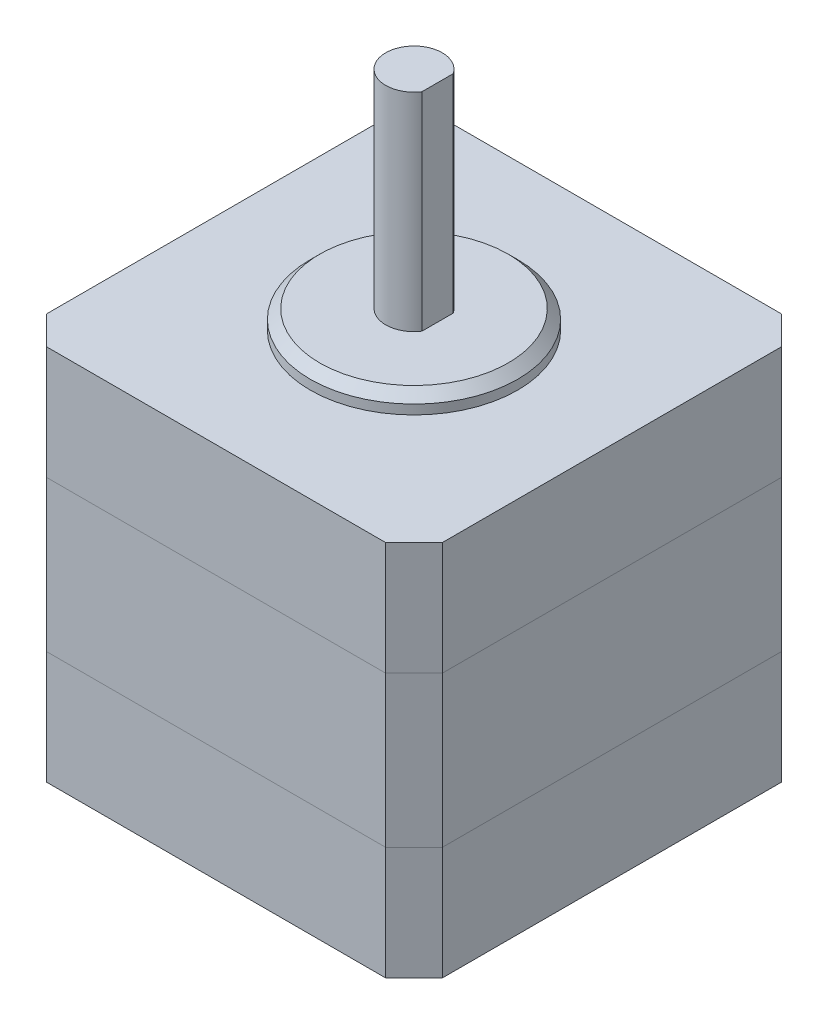
ISO-10303-21;
HEADER;
FILE_DESCRIPTION(('STEP AP214'),'2;1');
FILE_NAME('part.step','',(''),(''),'','','');
FILE_SCHEMA(('AUTOMOTIVE_DESIGN { 1 0 10303 214 1 1 1 1 }'));
ENDSEC;
DATA;
#1=APPLICATION_CONTEXT('core data for automotive mechanical design processes');
#2=APPLICATION_PROTOCOL_DEFINITION('international standard','automotive_design',2000,#1);
#3=PRODUCT_CONTEXT('',#1,'mechanical');
#4=PRODUCT('Part','Part','',(#3));
#5=PRODUCT_RELATED_PRODUCT_CATEGORY('part','',(#4));
#6=PRODUCT_DEFINITION_FORMATION('','',#4);
#7=PRODUCT_DEFINITION_CONTEXT('part definition',#1,'design');
#8=PRODUCT_DEFINITION('design','',#6,#7);
#9=PRODUCT_DEFINITION_SHAPE('','',#8);
#10=(LENGTH_UNIT() NAMED_UNIT(*) SI_UNIT(.MILLI.,.METRE.));
#11=(NAMED_UNIT(*) PLANE_ANGLE_UNIT() SI_UNIT($,.RADIAN.));
#12=(NAMED_UNIT(*) SI_UNIT($,.STERADIAN.) SOLID_ANGLE_UNIT());
#13=UNCERTAINTY_MEASURE_WITH_UNIT(LENGTH_MEASURE(1.E-05),#10,'distance_accuracy_value','');
#14=(GEOMETRIC_REPRESENTATION_CONTEXT(3) GLOBAL_UNCERTAINTY_ASSIGNED_CONTEXT((#13)) GLOBAL_UNIT_ASSIGNED_CONTEXT((#10,
#11,#12)) REPRESENTATION_CONTEXT('',''));
#15=CARTESIAN_POINT('',(0.,0.,0.));
#16=DIRECTION('',(0.,0.,1.));
#17=DIRECTION('',(1.,0.,0.));
#18=AXIS2_PLACEMENT_3D('',#15,#16,#17);
#19=CARTESIAN_POINT('',(-21.,40.,21.));
#20=DIRECTION('',(1.,0.,0.));
#21=DIRECTION('',(0.,0.,-1.));
#22=AXIS2_PLACEMENT_3D('',#19,#20,#21);
#23=PLANE('',#22);
#24=DIRECTION('',(0.,1.,0.));
#25=VECTOR('',#24,1.);
#26=CARTESIAN_POINT('',(-21.,40.,18.));
#27=LINE('',#26,#25);
#28=CARTESIAN_POINT('',(-21.,0.,18.));
#29=VERTEX_POINT('',#28);
#30=CARTESIAN_POINT('',(-21.,12.,18.));
#31=VERTEX_POINT('',#30);
#32=EDGE_CURVE('E299',#29,#31,#27,.T.);
#33=ORIENTED_EDGE('',*,*,#32,.T.);
#34=DIRECTION('',(0.,0.,-1.));
#35=VECTOR('',#34,1.);
#36=CARTESIAN_POINT('',(-21.,12.,21.));
#37=LINE('',#36,#35);
#38=CARTESIAN_POINT('',(-21.,12.,-18.));
#39=VERTEX_POINT('',#38);
#40=EDGE_CURVE('E204',#31,#39,#37,.T.);
#41=ORIENTED_EDGE('',*,*,#40,.T.);
#42=DIRECTION('',(0.,-1.,0.));
#43=VECTOR('',#42,1.);
#44=CARTESIAN_POINT('',(-21.,40.,-18.));
#45=LINE('',#44,#43);
#46=CARTESIAN_POINT('',(-21.,0.,-18.));
#47=VERTEX_POINT('',#46);
#48=EDGE_CURVE('E291',#39,#47,#45,.T.);
#49=ORIENTED_EDGE('',*,*,#48,.T.);
#50=DIRECTION('',(0.,0.,1.));
#51=VECTOR('',#50,1.);
#52=CARTESIAN_POINT('',(-21.,0.,21.));
#53=LINE('',#52,#51);
#54=EDGE_CURVE('E226',#47,#29,#53,.T.);
#55=ORIENTED_EDGE('',*,*,#54,.T.);
#56=EDGE_LOOP('',(#33,#41,#49,#55));
#57=FACE_BOUND('',#56,.T.);
#58=ADVANCED_FACE('F44',(#57),#23,.F.);
#59=CARTESIAN_POINT('',(-21.,40.,21.));
#60=DIRECTION('',(0.,0.,-1.));
#61=DIRECTION('',(-1.,0.,0.));
#62=AXIS2_PLACEMENT_3D('',#59,#60,#61);
#63=PLANE('',#62);
#64=DIRECTION('',(0.,1.,0.));
#65=VECTOR('',#64,1.);
#66=CARTESIAN_POINT('',(18.,40.,21.));
#67=LINE('',#66,#65);
#68=CARTESIAN_POINT('',(18.,0.,21.));
#69=VERTEX_POINT('',#68);
#70=CARTESIAN_POINT('',(18.,12.,21.));
#71=VERTEX_POINT('',#70);
#72=EDGE_CURVE('E287',#69,#71,#67,.T.);
#73=ORIENTED_EDGE('',*,*,#72,.T.);
#74=DIRECTION('',(-1.,0.,0.));
#75=VECTOR('',#74,1.);
#76=CARTESIAN_POINT('',(-21.,12.,21.));
#77=LINE('',#76,#75);
#78=CARTESIAN_POINT('',(-18.,12.,21.));
#79=VERTEX_POINT('',#78);
#80=EDGE_CURVE('E357',#71,#79,#77,.T.);
#81=ORIENTED_EDGE('',*,*,#80,.T.);
#82=DIRECTION('',(0.,-1.,0.));
#83=VECTOR('',#82,1.);
#84=CARTESIAN_POINT('',(-18.,40.,21.));
#85=LINE('',#84,#83);
#86=CARTESIAN_POINT('',(-18.,0.,21.));
#87=VERTEX_POINT('',#86);
#88=EDGE_CURVE('E280',#79,#87,#85,.T.);
#89=ORIENTED_EDGE('',*,*,#88,.T.);
#90=DIRECTION('',(1.,0.,0.));
#91=VECTOR('',#90,1.);
#92=CARTESIAN_POINT('',(-21.,0.,21.));
#93=LINE('',#92,#91);
#94=EDGE_CURVE('E210',#87,#69,#93,.T.);
#95=ORIENTED_EDGE('',*,*,#94,.T.);
#96=EDGE_LOOP('',(#73,#81,#89,#95));
#97=FACE_BOUND('',#96,.T.);
#98=ADVANCED_FACE('F375',(#97),#63,.F.);
#99=CARTESIAN_POINT('',(21.,40.,21.));
#100=DIRECTION('',(-1.,0.,0.));
#101=DIRECTION('',(0.,0.,1.));
#102=AXIS2_PLACEMENT_3D('',#99,#100,#101);
#103=PLANE('',#102);
#104=DIRECTION('',(0.,1.,0.));
#105=VECTOR('',#104,1.);
#106=CARTESIAN_POINT('',(21.,40.,-18.));
#107=LINE('',#106,#105);
#108=CARTESIAN_POINT('',(21.,0.,-18.));
#109=VERTEX_POINT('',#108);
#110=CARTESIAN_POINT('',(21.,12.,-18.));
#111=VERTEX_POINT('',#110);
#112=EDGE_CURVE('E263',#109,#111,#107,.T.);
#113=ORIENTED_EDGE('',*,*,#112,.T.);
#114=DIRECTION('',(0.,0.,1.));
#115=VECTOR('',#114,1.);
#116=CARTESIAN_POINT('',(21.,12.,21.));
#117=LINE('',#116,#115);
#118=CARTESIAN_POINT('',(21.,12.,18.));
#119=VERTEX_POINT('',#118);
#120=EDGE_CURVE('E354',#111,#119,#117,.T.);
#121=ORIENTED_EDGE('',*,*,#120,.T.);
#122=DIRECTION('',(0.,-1.,0.));
#123=VECTOR('',#122,1.);
#124=CARTESIAN_POINT('',(21.,40.,18.));
#125=LINE('',#124,#123);
#126=CARTESIAN_POINT('',(21.,0.,18.));
#127=VERTEX_POINT('',#126);
#128=EDGE_CURVE('E256',#119,#127,#125,.T.);
#129=ORIENTED_EDGE('',*,*,#128,.T.);
#130=DIRECTION('',(0.,0.,-1.));
#131=VECTOR('',#130,1.);
#132=CARTESIAN_POINT('',(21.,0.,21.));
#133=LINE('',#132,#131);
#134=EDGE_CURVE('E190',#127,#109,#133,.T.);
#135=ORIENTED_EDGE('',*,*,#134,.T.);
#136=EDGE_LOOP('',(#113,#121,#129,#135));
#137=FACE_BOUND('',#136,.T.);
#138=ADVANCED_FACE('F383',(#137),#103,.F.);
#139=CARTESIAN_POINT('',(-21.,40.,-21.));
#140=DIRECTION('',(0.,0.,1.));
#141=DIRECTION('',(1.,0.,0.));
#142=AXIS2_PLACEMENT_3D('',#139,#140,#141);
#143=PLANE('',#142);
#144=DIRECTION('',(0.,1.,0.));
#145=VECTOR('',#144,1.);
#146=CARTESIAN_POINT('',(-18.,40.,-21.));
#147=LINE('',#146,#145);
#148=CARTESIAN_POINT('',(-18.,0.,-21.));
#149=VERTEX_POINT('',#148);
#150=CARTESIAN_POINT('',(-18.,12.,-21.));
#151=VERTEX_POINT('',#150);
#152=EDGE_CURVE('E233',#149,#151,#147,.T.);
#153=ORIENTED_EDGE('',*,*,#152,.T.);
#154=DIRECTION('',(1.,0.,0.));
#155=VECTOR('',#154,1.);
#156=CARTESIAN_POINT('',(-21.,12.,-21.));
#157=LINE('',#156,#155);
#158=CARTESIAN_POINT('',(18.,12.,-21.));
#159=VERTEX_POINT('',#158);
#160=EDGE_CURVE('E68',#151,#159,#157,.T.);
#161=ORIENTED_EDGE('',*,*,#160,.T.);
#162=DIRECTION('',(0.,-1.,0.));
#163=VECTOR('',#162,1.);
#164=CARTESIAN_POINT('',(18.,40.,-21.));
#165=LINE('',#164,#163);
#166=CARTESIAN_POINT('',(18.,0.,-21.));
#167=VERTEX_POINT('',#166);
#168=EDGE_CURVE('E237',#159,#167,#165,.T.);
#169=ORIENTED_EDGE('',*,*,#168,.T.);
#170=DIRECTION('',(-1.,0.,0.));
#171=VECTOR('',#170,1.);
#172=CARTESIAN_POINT('',(-21.,0.,-21.));
#173=LINE('',#172,#171);
#174=EDGE_CURVE('E195',#167,#149,#173,.T.);
#175=ORIENTED_EDGE('',*,*,#174,.T.);
#176=EDGE_LOOP('',(#153,#161,#169,#175));
#177=FACE_BOUND('',#176,.T.);
#178=ADVANCED_FACE('F403',(#177),#143,.F.);
#179=CARTESIAN_POINT('',(-21.,40.,-18.));
#180=DIRECTION('',(0.707106781186546,0.,0.707106781186549));
#181=DIRECTION('',(0.,-1.,0.));
#182=AXIS2_PLACEMENT_3D('',#179,#180,#181);
#183=PLANE('',#182);
#184=CARTESIAN_POINT('',(-18.,28.,-21.));
#185=VERTEX_POINT('',#184);
#186=EDGE_CURVE('E238',#151,#185,#147,.T.);
#187=ORIENTED_EDGE('',*,*,#186,.F.);
#188=DIRECTION('',(-0.707106781186549,0.,0.707106781186546));
#189=VECTOR('',#188,1.);
#190=CARTESIAN_POINT('',(-21.,12.,-18.));
#191=LINE('',#190,#189);
#192=EDGE_CURVE('E348',#151,#39,#191,.T.);
#193=ORIENTED_EDGE('',*,*,#192,.T.);
#194=CARTESIAN_POINT('',(-21.,28.,-18.));
#195=VERTEX_POINT('',#194);
#196=EDGE_CURVE('E298',#195,#39,#45,.T.);
#197=ORIENTED_EDGE('',*,*,#196,.F.);
#198=DIRECTION('',(0.707106781186549,0.,-0.707106781186546));
#199=VECTOR('',#198,1.);
#200=CARTESIAN_POINT('',(-21.,28.,-18.));
#201=LINE('',#200,#199);
#202=EDGE_CURVE('E312',#195,#185,#201,.T.);
#203=ORIENTED_EDGE('',*,*,#202,.T.);
#204=EDGE_LOOP('',(#187,#193,#197,#203));
#205=FACE_BOUND('',#204,.T.);
#206=ADVANCED_FACE('F485',(#205),#183,.F.);
#207=CARTESIAN_POINT('',(-18.,40.,21.));
#208=DIRECTION('',(0.707106781186549,0.,-0.707106781186546));
#209=DIRECTION('',(0.,-1.,0.));
#210=AXIS2_PLACEMENT_3D('',#207,#208,#209);
#211=PLANE('',#210);
#212=CARTESIAN_POINT('',(-21.,28.,18.));
#213=VERTEX_POINT('',#212);
#214=EDGE_CURVE('E304',#31,#213,#27,.T.);
#215=ORIENTED_EDGE('',*,*,#214,.F.);
#216=DIRECTION('',(0.707106781186546,0.,0.707106781186549));
#217=VECTOR('',#216,1.);
#218=CARTESIAN_POINT('',(-18.,12.,21.));
#219=LINE('',#218,#217);
#220=EDGE_CURVE('E344',#31,#79,#219,.T.);
#221=ORIENTED_EDGE('',*,*,#220,.T.);
#222=CARTESIAN_POINT('',(-18.,28.,21.));
#223=VERTEX_POINT('',#222);
#224=EDGE_CURVE('E286',#223,#79,#85,.T.);
#225=ORIENTED_EDGE('',*,*,#224,.F.);
#226=DIRECTION('',(-0.707106781186546,0.,-0.707106781186549));
#227=VECTOR('',#226,1.);
#228=CARTESIAN_POINT('',(-18.,28.,21.));
#229=LINE('',#228,#227);
#230=EDGE_CURVE('E308',#223,#213,#229,.T.);
#231=ORIENTED_EDGE('',*,*,#230,.T.);
#232=EDGE_LOOP('',(#215,#221,#225,#231));
#233=FACE_BOUND('',#232,.T.);
#234=ADVANCED_FACE('F416',(#233),#211,.F.);
#235=CARTESIAN_POINT('',(21.,40.,18.));
#236=DIRECTION('',(-0.707106781186546,0.,-0.707106781186549));
#237=DIRECTION('',(0.,-1.,0.));
#238=AXIS2_PLACEMENT_3D('',#235,#236,#237);
#239=PLANE('',#238);
#240=CARTESIAN_POINT('',(18.,28.,21.));
#241=VERTEX_POINT('',#240);
#242=EDGE_CURVE('E292',#71,#241,#67,.T.);
#243=ORIENTED_EDGE('',*,*,#242,.F.);
#244=DIRECTION('',(0.707106781186549,0.,-0.707106781186546));
#245=VECTOR('',#244,1.);
#246=CARTESIAN_POINT('',(21.,12.,18.));
#247=LINE('',#246,#245);
#248=EDGE_CURVE('E340',#71,#119,#247,.T.);
#249=ORIENTED_EDGE('',*,*,#248,.T.);
#250=CARTESIAN_POINT('',(21.,28.,18.));
#251=VERTEX_POINT('',#250);
#252=EDGE_CURVE('E262',#251,#119,#125,.T.);
#253=ORIENTED_EDGE('',*,*,#252,.F.);
#254=DIRECTION('',(-0.707106781186549,0.,0.707106781186546));
#255=VECTOR('',#254,1.);
#256=CARTESIAN_POINT('',(21.,28.,18.));
#257=LINE('',#256,#255);
#258=EDGE_CURVE('E303',#251,#241,#257,.T.);
#259=ORIENTED_EDGE('',*,*,#258,.T.);
#260=EDGE_LOOP('',(#243,#249,#253,#259));
#261=FACE_BOUND('',#260,.T.);
#262=ADVANCED_FACE('F438',(#261),#239,.F.);
#263=CARTESIAN_POINT('',(18.,40.,-21.));
#264=DIRECTION('',(-0.707106781186549,0.,0.707106781186546));
#265=DIRECTION('',(0.,-1.,0.));
#266=AXIS2_PLACEMENT_3D('',#263,#264,#265);
#267=PLANE('',#266);
#268=CARTESIAN_POINT('',(21.,28.,-18.));
#269=VERTEX_POINT('',#268);
#270=EDGE_CURVE('E268',#111,#269,#107,.T.);
#271=ORIENTED_EDGE('',*,*,#270,.F.);
#272=DIRECTION('',(-0.707106781186546,0.,-0.707106781186549));
#273=VECTOR('',#272,1.);
#274=CARTESIAN_POINT('',(18.,12.,-21.));
#275=LINE('',#274,#273);
#276=EDGE_CURVE('E336',#111,#159,#275,.T.);
#277=ORIENTED_EDGE('',*,*,#276,.T.);
#278=CARTESIAN_POINT('',(18.,28.,-21.));
#279=VERTEX_POINT('',#278);
#280=EDGE_CURVE('E244',#279,#159,#165,.T.);
#281=ORIENTED_EDGE('',*,*,#280,.F.);
#282=DIRECTION('',(0.707106781186546,0.,0.707106781186549));
#283=VECTOR('',#282,1.);
#284=CARTESIAN_POINT('',(18.,28.,-21.));
#285=LINE('',#284,#283);
#286=EDGE_CURVE('E316',#279,#269,#285,.T.);
#287=ORIENTED_EDGE('',*,*,#286,.T.);
#288=EDGE_LOOP('',(#271,#277,#281,#287));
#289=FACE_BOUND('',#288,.T.);
#290=ADVANCED_FACE('F391',(#289),#267,.F.);
#291=CARTESIAN_POINT('',(-21.,40.,-18.));
#292=VERTEX_POINT('',#291);
#293=EDGE_CURVE('E293',#292,#195,#45,.T.);
#294=ORIENTED_EDGE('',*,*,#293,.T.);
#295=DIRECTION('',(0.,0.,1.));
#296=VECTOR('',#295,1.);
#297=CARTESIAN_POINT('',(-21.,28.,21.));
#298=LINE('',#297,#296);
#299=EDGE_CURVE('E332',#195,#213,#298,.T.);
#300=ORIENTED_EDGE('',*,*,#299,.T.);
#301=CARTESIAN_POINT('',(-21.,40.,18.));
#302=VERTEX_POINT('',#301);
#303=EDGE_CURVE('E297',#213,#302,#27,.T.);
#304=ORIENTED_EDGE('',*,*,#303,.T.);
#305=DIRECTION('',(0.,0.,1.));
#306=VECTOR('',#305,1.);
#307=CARTESIAN_POINT('',(-21.,40.,21.));
#308=LINE('',#307,#306);
#309=EDGE_CURVE('E214',#292,#302,#308,.T.);
#310=ORIENTED_EDGE('',*,*,#309,.F.);
#311=EDGE_LOOP('',(#294,#300,#304,#310));
#312=FACE_BOUND('',#311,.T.);
#313=ADVANCED_FACE('F378',(#312),#23,.F.);
#314=CARTESIAN_POINT('',(18.,40.,-21.));
#315=VERTEX_POINT('',#314);
#316=EDGE_CURVE('E239',#315,#279,#165,.T.);
#317=ORIENTED_EDGE('',*,*,#316,.T.);
#318=DIRECTION('',(-1.,0.,0.));
#319=VECTOR('',#318,1.);
#320=CARTESIAN_POINT('',(-21.,28.,-21.));
#321=LINE('',#320,#319);
#322=EDGE_CURVE('E328',#279,#185,#321,.T.);
#323=ORIENTED_EDGE('',*,*,#322,.T.);
#324=CARTESIAN_POINT('',(-18.,40.,-21.));
#325=VERTEX_POINT('',#324);
#326=EDGE_CURVE('E221',#185,#325,#147,.T.);
#327=ORIENTED_EDGE('',*,*,#326,.T.);
#328=DIRECTION('',(-1.,0.,0.));
#329=VECTOR('',#328,1.);
#330=CARTESIAN_POINT('',(-21.,40.,-21.));
#331=LINE('',#330,#329);
#332=EDGE_CURVE('E209',#315,#325,#331,.T.);
#333=ORIENTED_EDGE('',*,*,#332,.F.);
#334=EDGE_LOOP('',(#317,#323,#327,#333));
#335=FACE_BOUND('',#334,.T.);
#336=ADVANCED_FACE('F390',(#335),#143,.F.);
#337=CARTESIAN_POINT('',(-18.,40.,21.));
#338=VERTEX_POINT('',#337);
#339=EDGE_CURVE('E281',#338,#223,#85,.T.);
#340=ORIENTED_EDGE('',*,*,#339,.T.);
#341=DIRECTION('',(1.,0.,0.));
#342=VECTOR('',#341,1.);
#343=CARTESIAN_POINT('',(-21.,28.,21.));
#344=LINE('',#343,#342);
#345=EDGE_CURVE('E324',#223,#241,#344,.T.);
#346=ORIENTED_EDGE('',*,*,#345,.T.);
#347=CARTESIAN_POINT('',(18.,40.,21.));
#348=VERTEX_POINT('',#347);
#349=EDGE_CURVE('E285',#241,#348,#67,.T.);
#350=ORIENTED_EDGE('',*,*,#349,.T.);
#351=DIRECTION('',(1.,0.,0.));
#352=VECTOR('',#351,1.);
#353=CARTESIAN_POINT('',(-21.,40.,21.));
#354=LINE('',#353,#352);
#355=EDGE_CURVE('E218',#338,#348,#354,.T.);
#356=ORIENTED_EDGE('',*,*,#355,.F.);
#357=EDGE_LOOP('',(#340,#346,#350,#356));
#358=FACE_BOUND('',#357,.T.);
#359=ADVANCED_FACE('F386',(#358),#63,.F.);
#360=CARTESIAN_POINT('',(21.,40.,18.));
#361=VERTEX_POINT('',#360);
#362=EDGE_CURVE('E257',#361,#251,#125,.T.);
#363=ORIENTED_EDGE('',*,*,#362,.T.);
#364=DIRECTION('',(0.,0.,-1.));
#365=VECTOR('',#364,1.);
#366=CARTESIAN_POINT('',(21.,28.,21.));
#367=LINE('',#366,#365);
#368=EDGE_CURVE('E320',#251,#269,#367,.T.);
#369=ORIENTED_EDGE('',*,*,#368,.T.);
#370=CARTESIAN_POINT('',(21.,40.,-18.));
#371=VERTEX_POINT('',#370);
#372=EDGE_CURVE('E261',#269,#371,#107,.T.);
#373=ORIENTED_EDGE('',*,*,#372,.T.);
#374=DIRECTION('',(0.,0.,-1.));
#375=VECTOR('',#374,1.);
#376=CARTESIAN_POINT('',(21.,40.,21.));
#377=LINE('',#376,#375);
#378=EDGE_CURVE('E205',#361,#371,#377,.T.);
#379=ORIENTED_EDGE('',*,*,#378,.F.);
#380=EDGE_LOOP('',(#363,#369,#373,#379));
#381=FACE_BOUND('',#380,.T.);
#382=ADVANCED_FACE('F454',(#381),#103,.F.);
#383=ORIENTED_EDGE('',*,*,#276,.F.);
#384=ORIENTED_EDGE('',*,*,#112,.F.);
#385=DIRECTION('',(-0.707106781186546,0.,-0.707106781186549));
#386=VECTOR('',#385,1.);
#387=CARTESIAN_POINT('',(19.5,0.,-19.5));
#388=LINE('',#387,#386);
#389=EDGE_CURVE('E253',#167,#109,#388,.F.);
#390=ORIENTED_EDGE('',*,*,#389,.F.);
#391=ORIENTED_EDGE('',*,*,#168,.F.);
#392=EDGE_LOOP('',(#383,#384,#390,#391));
#393=FACE_BOUND('',#392,.T.);
#394=ADVANCED_FACE('F494',(#393),#267,.F.);
#395=ORIENTED_EDGE('',*,*,#192,.F.);
#396=ORIENTED_EDGE('',*,*,#152,.F.);
#397=DIRECTION('',(-0.707106781186549,0.,0.707106781186546));
#398=VECTOR('',#397,1.);
#399=CARTESIAN_POINT('',(-19.5,0.,-19.5));
#400=LINE('',#399,#398);
#401=EDGE_CURVE('E243',#47,#149,#400,.F.);
#402=ORIENTED_EDGE('',*,*,#401,.F.);
#403=ORIENTED_EDGE('',*,*,#48,.F.);
#404=EDGE_LOOP('',(#395,#396,#402,#403));
#405=FACE_BOUND('',#404,.T.);
#406=ADVANCED_FACE('F489',(#405),#183,.F.);
#407=ORIENTED_EDGE('',*,*,#220,.F.);
#408=ORIENTED_EDGE('',*,*,#32,.F.);
#409=DIRECTION('',(0.707106781186546,0.,0.707106781186549));
#410=VECTOR('',#409,1.);
#411=CARTESIAN_POINT('',(-19.5,0.,19.5));
#412=LINE('',#411,#410);
#413=EDGE_CURVE('E247',#87,#29,#412,.F.);
#414=ORIENTED_EDGE('',*,*,#413,.F.);
#415=ORIENTED_EDGE('',*,*,#88,.F.);
#416=EDGE_LOOP('',(#407,#408,#414,#415));
#417=FACE_BOUND('',#416,.T.);
#418=ADVANCED_FACE('F411',(#417),#211,.F.);
#419=ORIENTED_EDGE('',*,*,#248,.F.);
#420=ORIENTED_EDGE('',*,*,#72,.F.);
#421=DIRECTION('',(0.707106781186549,0.,-0.707106781186546));
#422=VECTOR('',#421,1.);
#423=CARTESIAN_POINT('',(19.5,0.,19.5));
#424=LINE('',#423,#422);
#425=EDGE_CURVE('E250',#127,#69,#424,.F.);
#426=ORIENTED_EDGE('',*,*,#425,.F.);
#427=ORIENTED_EDGE('',*,*,#128,.F.);
#428=EDGE_LOOP('',(#419,#420,#426,#427));
#429=FACE_BOUND('',#428,.T.);
#430=ADVANCED_FACE('F432',(#429),#239,.F.);
#431=ORIENTED_EDGE('',*,*,#120,.F.);
#432=ORIENTED_EDGE('',*,*,#270,.T.);
#433=ORIENTED_EDGE('',*,*,#368,.F.);
#434=ORIENTED_EDGE('',*,*,#252,.T.);
#435=EDGE_LOOP('',(#431,#432,#433,#434));
#436=FACE_BOUND('',#435,.T.);
#437=ADVANCED_FACE('F402',(#436),#103,.F.);
#438=ORIENTED_EDGE('',*,*,#160,.F.);
#439=ORIENTED_EDGE('',*,*,#186,.T.);
#440=ORIENTED_EDGE('',*,*,#322,.F.);
#441=ORIENTED_EDGE('',*,*,#280,.T.);
#442=EDGE_LOOP('',(#438,#439,#440,#441));
#443=FACE_BOUND('',#442,.T.);
#444=ADVANCED_FACE('F394',(#443),#143,.F.);
#445=ORIENTED_EDGE('',*,*,#40,.F.);
#446=ORIENTED_EDGE('',*,*,#214,.T.);
#447=ORIENTED_EDGE('',*,*,#299,.F.);
#448=ORIENTED_EDGE('',*,*,#196,.T.);
#449=EDGE_LOOP('',(#445,#446,#447,#448));
#450=FACE_BOUND('',#449,.T.);
#451=ADVANCED_FACE('F379',(#450),#23,.F.);
#452=ORIENTED_EDGE('',*,*,#80,.F.);
#453=ORIENTED_EDGE('',*,*,#242,.T.);
#454=ORIENTED_EDGE('',*,*,#345,.F.);
#455=ORIENTED_EDGE('',*,*,#224,.T.);
#456=EDGE_LOOP('',(#452,#453,#454,#455));
#457=FACE_BOUND('',#456,.T.);
#458=ADVANCED_FACE('F387',(#457),#63,.F.);
#459=CARTESIAN_POINT('',(0.,40.,0.));
#460=DIRECTION('',(0.,-1.,0.));
#461=DIRECTION('',(0.,0.,-1.));
#462=AXIS2_PLACEMENT_3D('',#459,#460,#461);
#463=PLANE('',#462);
#464=CARTESIAN_POINT('',(0.,40.,0.));
#465=DIRECTION('',(0.,1.,0.));
#466=DIRECTION('',(0.,0.,1.));
#467=AXIS2_PLACEMENT_3D('',#464,#465,#466);
#468=CIRCLE('',#467,11.);
#469=CARTESIAN_POINT('',(0.,40.,11.));
#470=VERTEX_POINT('',#469);
#471=EDGE_CURVE('E200',#470,#470,#468,.T.);
#472=ORIENTED_EDGE('',*,*,#471,.F.);
#473=EDGE_LOOP('',(#472));
#474=FACE_BOUND('',#473,.T.);
#475=ORIENTED_EDGE('',*,*,#378,.T.);
#476=DIRECTION('',(0.707106781186546,0.,0.707106781186549));
#477=VECTOR('',#476,1.);
#478=CARTESIAN_POINT('',(18.,40.,-21.));
#479=LINE('',#478,#477);
#480=EDGE_CURVE('E277',#371,#315,#479,.F.);
#481=ORIENTED_EDGE('',*,*,#480,.T.);
#482=ORIENTED_EDGE('',*,*,#332,.T.);
#483=DIRECTION('',(0.707106781186549,0.,-0.707106781186546));
#484=VECTOR('',#483,1.);
#485=CARTESIAN_POINT('',(-21.,40.,-18.));
#486=LINE('',#485,#484);
#487=EDGE_CURVE('E267',#325,#292,#486,.F.);
#488=ORIENTED_EDGE('',*,*,#487,.T.);
#489=ORIENTED_EDGE('',*,*,#309,.T.);
#490=DIRECTION('',(-0.707106781186546,0.,-0.707106781186549));
#491=VECTOR('',#490,1.);
#492=CARTESIAN_POINT('',(-18.,40.,21.));
#493=LINE('',#492,#491);
#494=EDGE_CURVE('E271',#302,#338,#493,.F.);
#495=ORIENTED_EDGE('',*,*,#494,.T.);
#496=ORIENTED_EDGE('',*,*,#355,.T.);
#497=DIRECTION('',(-0.707106781186549,0.,0.707106781186546));
#498=VECTOR('',#497,1.);
#499=CARTESIAN_POINT('',(21.,40.,18.));
#500=LINE('',#499,#498);
#501=EDGE_CURVE('E274',#348,#361,#500,.F.);
#502=ORIENTED_EDGE('',*,*,#501,.T.);
#503=EDGE_LOOP('',(#475,#481,#482,#488,#489,#495,#496,#502));
#504=FACE_BOUND('',#503,.T.);
#505=ADVANCED_FACE('F400',(#474,#504),#463,.F.);
#506=CARTESIAN_POINT('',(0.,0.,0.));
#507=DIRECTION('',(0.,-1.,0.));
#508=DIRECTION('',(0.,0.,-1.));
#509=AXIS2_PLACEMENT_3D('',#506,#507,#508);
#510=PLANE('',#509);
#511=ORIENTED_EDGE('',*,*,#174,.F.);
#512=ORIENTED_EDGE('',*,*,#389,.T.);
#513=ORIENTED_EDGE('',*,*,#134,.F.);
#514=ORIENTED_EDGE('',*,*,#425,.T.);
#515=ORIENTED_EDGE('',*,*,#94,.F.);
#516=ORIENTED_EDGE('',*,*,#413,.T.);
#517=ORIENTED_EDGE('',*,*,#54,.F.);
#518=ORIENTED_EDGE('',*,*,#401,.T.);
#519=EDGE_LOOP('',(#511,#512,#513,#514,#515,#516,#517,#518));
#520=FACE_BOUND('',#519,.T.);
#521=ADVANCED_FACE('F425',(#520),#510,.T.);
#522=ORIENTED_EDGE('',*,*,#286,.F.);
#523=ORIENTED_EDGE('',*,*,#316,.F.);
#524=ORIENTED_EDGE('',*,*,#480,.F.);
#525=ORIENTED_EDGE('',*,*,#372,.F.);
#526=EDGE_LOOP('',(#522,#523,#524,#525));
#527=FACE_BOUND('',#526,.T.);
#528=ADVANCED_FACE('F461',(#527),#267,.F.);
#529=ORIENTED_EDGE('',*,*,#258,.F.);
#530=ORIENTED_EDGE('',*,*,#362,.F.);
#531=ORIENTED_EDGE('',*,*,#501,.F.);
#532=ORIENTED_EDGE('',*,*,#349,.F.);
#533=EDGE_LOOP('',(#529,#530,#531,#532));
#534=FACE_BOUND('',#533,.T.);
#535=ADVANCED_FACE('F452',(#534),#239,.F.);
#536=ORIENTED_EDGE('',*,*,#230,.F.);
#537=ORIENTED_EDGE('',*,*,#339,.F.);
#538=ORIENTED_EDGE('',*,*,#494,.F.);
#539=ORIENTED_EDGE('',*,*,#303,.F.);
#540=EDGE_LOOP('',(#536,#537,#538,#539));
#541=FACE_BOUND('',#540,.T.);
#542=ADVANCED_FACE('F472',(#541),#211,.F.);
#543=ORIENTED_EDGE('',*,*,#202,.F.);
#544=ORIENTED_EDGE('',*,*,#293,.F.);
#545=ORIENTED_EDGE('',*,*,#487,.F.);
#546=ORIENTED_EDGE('',*,*,#326,.F.);
#547=EDGE_LOOP('',(#543,#544,#545,#546));
#548=FACE_BOUND('',#547,.T.);
#549=ADVANCED_FACE('F470',(#548),#183,.F.);
#550=CARTESIAN_POINT('',(0.,42.,0.));
#551=DIRECTION('',(0.,-1.,0.));
#552=DIRECTION('',(0.,0.,-1.));
#553=AXIS2_PLACEMENT_3D('',#550,#551,#552);
#554=CYLINDRICAL_SURFACE('',#553,11.);
#555=CARTESIAN_POINT('',(0.,41.,0.));
#556=DIRECTION('',(0.,1.,0.));
#557=DIRECTION('',(0.,0.,1.));
#558=AXIS2_PLACEMENT_3D('',#555,#556,#557);
#559=CIRCLE('',#558,11.);
#560=CARTESIAN_POINT('',(0.,41.,11.));
#561=VERTEX_POINT('',#560);
#562=EDGE_CURVE('E12',#561,#561,#559,.F.);
#563=ORIENTED_EDGE('',*,*,#562,.T.);
#564=EDGE_LOOP('',(#563));
#565=FACE_BOUND('',#564,.T.);
#566=ORIENTED_EDGE('',*,*,#471,.T.);
#567=EDGE_LOOP('',(#566));
#568=FACE_BOUND('',#567,.T.);
#569=ADVANCED_FACE('F504',(#565,#568),#554,.T.);
#570=CARTESIAN_POINT('',(0.,42.,0.));
#571=DIRECTION('',(0.,1.,0.));
#572=DIRECTION('',(0.,0.,1.));
#573=AXIS2_PLACEMENT_3D('',#570,#571,#572);
#574=PLANE('',#573);
#575=CARTESIAN_POINT('',(0.,42.,0.));
#576=DIRECTION('',(0.,1.,0.));
#577=DIRECTION('',(0.,0.,1.));
#578=AXIS2_PLACEMENT_3D('',#575,#576,#577);
#579=CIRCLE('',#578,10.);
#580=CARTESIAN_POINT('',(0.,42.,10.));
#581=VERTEX_POINT('',#580);
#582=EDGE_CURVE('E54',#581,#581,#579,.T.);
#583=ORIENTED_EDGE('',*,*,#582,.T.);
#584=EDGE_LOOP('',(#583));
#585=FACE_BOUND('',#584,.T.);
#586=CARTESIAN_POINT('',(0.,42.,0.));
#587=DIRECTION('',(0.,1.,0.));
#588=DIRECTION('',(0.,0.,1.));
#589=AXIS2_PLACEMENT_3D('',#586,#587,#588);
#590=CIRCLE('',#589,3.);
#591=CARTESIAN_POINT('',(2.5,42.,-1.6583123951777));
#592=VERTEX_POINT('',#591);
#593=CARTESIAN_POINT('',(2.5,42.,1.6583123951777));
#594=VERTEX_POINT('',#593);
#595=EDGE_CURVE('E188',#592,#594,#590,.T.);
#596=ORIENTED_EDGE('',*,*,#595,.F.);
#597=DIRECTION('',(0.,0.,-1.));
#598=VECTOR('',#597,1.);
#599=CARTESIAN_POINT('',(2.5,42.,-1.6583123951777));
#600=LINE('',#599,#598);
#601=EDGE_CURVE('E60',#594,#592,#600,.T.);
#602=ORIENTED_EDGE('',*,*,#601,.F.);
#603=EDGE_LOOP('',(#596,#602));
#604=FACE_BOUND('',#603,.T.);
#605=ADVANCED_FACE('F365',(#585,#604),#574,.T.);
#606=CARTESIAN_POINT('',(0.,64.,0.));
#607=DIRECTION('',(0.,-1.,0.));
#608=DIRECTION('',(0.,0.,-1.));
#609=AXIS2_PLACEMENT_3D('',#606,#607,#608);
#610=CYLINDRICAL_SURFACE('',#609,3.);
#611=ORIENTED_EDGE('',*,*,#595,.T.);
#612=DIRECTION('',(0.,-1.,0.));
#613=VECTOR('',#612,1.);
#614=CARTESIAN_POINT('',(2.5,64.,1.6583123951777));
#615=LINE('',#614,#613);
#616=CARTESIAN_POINT('',(2.5,64.,1.6583123951777));
#617=VERTEX_POINT('',#616);
#618=EDGE_CURVE('E174',#617,#594,#615,.T.);
#619=ORIENTED_EDGE('',*,*,#618,.F.);
#620=CARTESIAN_POINT('',(0.,64.,0.));
#621=DIRECTION('',(0.,1.,0.));
#622=DIRECTION('',(0.,0.,1.));
#623=AXIS2_PLACEMENT_3D('',#620,#621,#622);
#624=CIRCLE('',#623,3.);
#625=CARTESIAN_POINT('',(2.5,64.,-1.6583123951777));
#626=VERTEX_POINT('',#625);
#627=EDGE_CURVE('E181',#626,#617,#624,.T.);
#628=ORIENTED_EDGE('',*,*,#627,.F.);
#629=DIRECTION('',(0.,-1.,0.));
#630=VECTOR('',#629,1.);
#631=CARTESIAN_POINT('',(2.5,64.,-1.6583123951777));
#632=LINE('',#631,#630);
#633=EDGE_CURVE('E177',#626,#592,#632,.T.);
#634=ORIENTED_EDGE('',*,*,#633,.T.);
#635=EDGE_LOOP('',(#611,#619,#628,#634));
#636=FACE_BOUND('',#635,.T.);
#637=ADVANCED_FACE('F187',(#636),#610,.T.);
#638=CARTESIAN_POINT('',(2.5,64.,-1.6583123951777));
#639=DIRECTION('',(-1.,0.,0.));
#640=DIRECTION('',(0.,0.,1.));
#641=AXIS2_PLACEMENT_3D('',#638,#639,#640);
#642=PLANE('',#641);
#643=ORIENTED_EDGE('',*,*,#601,.T.);
#644=ORIENTED_EDGE('',*,*,#633,.F.);
#645=DIRECTION('',(0.,0.,-1.));
#646=VECTOR('',#645,1.);
#647=CARTESIAN_POINT('',(2.5,64.,-1.6583123951777));
#648=LINE('',#647,#646);
#649=EDGE_CURVE('E170',#617,#626,#648,.T.);
#650=ORIENTED_EDGE('',*,*,#649,.F.);
#651=ORIENTED_EDGE('',*,*,#618,.T.);
#652=EDGE_LOOP('',(#643,#644,#650,#651));
#653=FACE_BOUND('',#652,.T.);
#654=ADVANCED_FACE('F172',(#653),#642,.F.);
#655=CARTESIAN_POINT('',(0.,64.,0.));
#656=DIRECTION('',(0.,1.,0.));
#657=DIRECTION('',(0.,0.,1.));
#658=AXIS2_PLACEMENT_3D('',#655,#656,#657);
#659=PLANE('',#658);
#660=ORIENTED_EDGE('',*,*,#627,.T.);
#661=ORIENTED_EDGE('',*,*,#649,.T.);
#662=EDGE_LOOP('',(#660,#661));
#663=FACE_BOUND('',#662,.T.);
#664=ADVANCED_FACE('F183',(#663),#659,.T.);
#665=CARTESIAN_POINT('',(0.,42.,0.));
#666=DIRECTION('',(0.,-1.,0.));
#667=DIRECTION('',(0.,0.,-1.));
#668=AXIS2_PLACEMENT_3D('',#665,#666,#667);
#669=CONICAL_SURFACE('',#668,10.,0.785398163397443);
#670=ORIENTED_EDGE('',*,*,#562,.F.);
#671=EDGE_LOOP('',(#670));
#672=FACE_BOUND('',#671,.T.);
#673=ORIENTED_EDGE('',*,*,#582,.F.);
#674=EDGE_LOOP('',(#673));
#675=FACE_BOUND('',#674,.T.);
#676=ADVANCED_FACE('F47',(#672,#675),#669,.T.);
#677=CLOSED_SHELL('',(#58,#98,#138,#178,#206,#234,#262,#290,#313,#336,#359,#382,#394,#406,#418,
#430,#437,#444,#451,#458,#505,#521,#528,#535,#542,#549,#569,#605,#637,#654,#664,#676));
#678=MANIFOLD_SOLID_BREP('B2',#677);
#679=ADVANCED_BREP_SHAPE_REPRESENTATION('',(#18,#678),#14);
#680=SHAPE_DEFINITION_REPRESENTATION(#9,#679);
ENDSEC;
END-ISO-10303-21;
